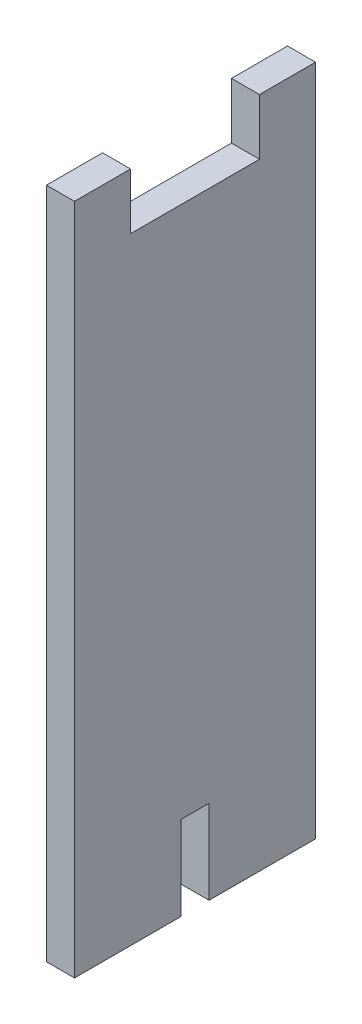
ISO-10303-21;
HEADER;
FILE_DESCRIPTION(('STEP AP214'),'2;1');
FILE_NAME('part.step','',(''),(''),'','','');
FILE_SCHEMA(('AUTOMOTIVE_DESIGN { 1 0 10303 214 1 1 1 1 }'));
ENDSEC;
DATA;
#1=APPLICATION_CONTEXT('core data for automotive mechanical design processes');
#2=APPLICATION_PROTOCOL_DEFINITION('international standard','automotive_design',2000,#1);
#3=PRODUCT_CONTEXT('',#1,'mechanical');
#4=PRODUCT('Part','Part','',(#3));
#5=PRODUCT_RELATED_PRODUCT_CATEGORY('part','',(#4));
#6=PRODUCT_DEFINITION_FORMATION('','',#4);
#7=PRODUCT_DEFINITION_CONTEXT('part definition',#1,'design');
#8=PRODUCT_DEFINITION('design','',#6,#7);
#9=PRODUCT_DEFINITION_SHAPE('','',#8);
#10=(LENGTH_UNIT() NAMED_UNIT(*) SI_UNIT(.MILLI.,.METRE.));
#11=(NAMED_UNIT(*) PLANE_ANGLE_UNIT() SI_UNIT($,.RADIAN.));
#12=(NAMED_UNIT(*) SI_UNIT($,.STERADIAN.) SOLID_ANGLE_UNIT());
#13=UNCERTAINTY_MEASURE_WITH_UNIT(LENGTH_MEASURE(1.E-05),#10,'distance_accuracy_value','');
#14=(GEOMETRIC_REPRESENTATION_CONTEXT(3) GLOBAL_UNCERTAINTY_ASSIGNED_CONTEXT((#13)) GLOBAL_UNIT_ASSIGNED_CONTEXT((#10,
#11,#12)) REPRESENTATION_CONTEXT('',''));
#15=CARTESIAN_POINT('',(0.,0.,0.));
#16=DIRECTION('',(0.,0.,1.));
#17=DIRECTION('',(1.,0.,0.));
#18=AXIS2_PLACEMENT_3D('',#15,#16,#17);
#19=CARTESIAN_POINT('',(5.,0.,0.));
#20=DIRECTION('',(0.,0.,1.));
#21=DIRECTION('',(0.,-1.,0.));
#22=AXIS2_PLACEMENT_3D('',#19,#20,#21);
#23=PLANE('',#22);
#24=DIRECTION('',(0.,1.,0.));
#25=VECTOR('',#24,1.);
#26=CARTESIAN_POINT('',(0.,0.,0.));
#27=LINE('',#26,#25);
#28=CARTESIAN_POINT('',(0.,0.,0.));
#29=VERTEX_POINT('',#28);
#30=CARTESIAN_POINT('',(0.,120.,0.));
#31=VERTEX_POINT('',#30);
#32=EDGE_CURVE('E156',#29,#31,#27,.T.);
#33=ORIENTED_EDGE('',*,*,#32,.T.);
#34=DIRECTION('',(-1.,0.,0.));
#35=VECTOR('',#34,1.);
#36=CARTESIAN_POINT('',(5.,120.,0.));
#37=LINE('',#36,#35);
#38=CARTESIAN_POINT('',(5.,120.,0.));
#39=VERTEX_POINT('',#38);
#40=EDGE_CURVE('E11',#39,#31,#37,.T.);
#41=ORIENTED_EDGE('',*,*,#40,.F.);
#42=DIRECTION('',(0.,1.,0.));
#43=VECTOR('',#42,1.);
#44=CARTESIAN_POINT('',(5.,0.,0.));
#45=LINE('',#44,#43);
#46=CARTESIAN_POINT('',(5.,0.,0.));
#47=VERTEX_POINT('',#46);
#48=EDGE_CURVE('E180',#47,#39,#45,.T.);
#49=ORIENTED_EDGE('',*,*,#48,.F.);
#50=DIRECTION('',(-1.,0.,0.));
#51=VECTOR('',#50,1.);
#52=CARTESIAN_POINT('',(5.,0.,0.));
#53=LINE('',#52,#51);
#54=EDGE_CURVE('E152',#47,#29,#53,.T.);
#55=ORIENTED_EDGE('',*,*,#54,.T.);
#56=EDGE_LOOP('',(#33,#41,#49,#55));
#57=FACE_BOUND('',#56,.T.);
#58=ADVANCED_FACE('F36',(#57),#23,.F.);
#59=CARTESIAN_POINT('',(5.,120.,0.));
#60=DIRECTION('',(0.,-1.,0.));
#61=DIRECTION('',(0.,0.,-1.));
#62=AXIS2_PLACEMENT_3D('',#59,#60,#61);
#63=PLANE('',#62);
#64=DIRECTION('',(0.,0.,1.));
#65=VECTOR('',#64,1.);
#66=CARTESIAN_POINT('',(0.,120.,0.));
#67=LINE('',#66,#65);
#68=CARTESIAN_POINT('',(0.,120.,10.));
#69=VERTEX_POINT('',#68);
#70=EDGE_CURVE('E159',#31,#69,#67,.T.);
#71=ORIENTED_EDGE('',*,*,#70,.T.);
#72=DIRECTION('',(-1.,0.,0.));
#73=VECTOR('',#72,1.);
#74=CARTESIAN_POINT('',(5.,120.,10.));
#75=LINE('',#74,#73);
#76=CARTESIAN_POINT('',(5.,120.,10.));
#77=VERTEX_POINT('',#76);
#78=EDGE_CURVE('E44',#77,#69,#75,.T.);
#79=ORIENTED_EDGE('',*,*,#78,.F.);
#80=DIRECTION('',(0.,0.,1.));
#81=VECTOR('',#80,1.);
#82=CARTESIAN_POINT('',(5.,120.,0.));
#83=LINE('',#82,#81);
#84=EDGE_CURVE('E107',#39,#77,#83,.T.);
#85=ORIENTED_EDGE('',*,*,#84,.F.);
#86=ORIENTED_EDGE('',*,*,#40,.T.);
#87=EDGE_LOOP('',(#71,#79,#85,#86));
#88=FACE_BOUND('',#87,.T.);
#89=ADVANCED_FACE('F207',(#88),#63,.F.);
#90=CARTESIAN_POINT('',(5.,110.,10.));
#91=DIRECTION('',(0.,0.,-1.));
#92=DIRECTION('',(0.,1.,0.));
#93=AXIS2_PLACEMENT_3D('',#90,#91,#92);
#94=PLANE('',#93);
#95=DIRECTION('',(0.,-1.,0.));
#96=VECTOR('',#95,1.);
#97=CARTESIAN_POINT('',(0.,110.,10.));
#98=LINE('',#97,#96);
#99=CARTESIAN_POINT('',(0.,110.,10.));
#100=VERTEX_POINT('',#99);
#101=EDGE_CURVE('E162',#69,#100,#98,.T.);
#102=ORIENTED_EDGE('',*,*,#101,.T.);
#103=DIRECTION('',(-1.,0.,0.));
#104=VECTOR('',#103,1.);
#105=CARTESIAN_POINT('',(5.,110.,10.));
#106=LINE('',#105,#104);
#107=CARTESIAN_POINT('',(5.,110.,10.));
#108=VERTEX_POINT('',#107);
#109=EDGE_CURVE('E199',#108,#100,#106,.T.);
#110=ORIENTED_EDGE('',*,*,#109,.F.);
#111=DIRECTION('',(0.,-1.,0.));
#112=VECTOR('',#111,1.);
#113=CARTESIAN_POINT('',(5.,111.226045357857,10.));
#114=LINE('',#113,#112);
#115=EDGE_CURVE('E206',#77,#108,#114,.T.);
#116=ORIENTED_EDGE('',*,*,#115,.F.);
#117=ORIENTED_EDGE('',*,*,#78,.T.);
#118=EDGE_LOOP('',(#102,#110,#116,#117));
#119=FACE_BOUND('',#118,.T.);
#120=ADVANCED_FACE('F204',(#119),#94,.F.);
#121=CARTESIAN_POINT('',(5.,110.,33.));
#122=DIRECTION('',(0.,-1.,0.));
#123=DIRECTION('',(0.,0.,-1.));
#124=AXIS2_PLACEMENT_3D('',#121,#122,#123);
#125=PLANE('',#124);
#126=DIRECTION('',(0.,0.,1.));
#127=VECTOR('',#126,1.);
#128=CARTESIAN_POINT('',(0.,110.,33.));
#129=LINE('',#128,#127);
#130=CARTESIAN_POINT('',(0.,110.,33.));
#131=VERTEX_POINT('',#130);
#132=EDGE_CURVE('E164',#100,#131,#129,.T.);
#133=ORIENTED_EDGE('',*,*,#132,.T.);
#134=DIRECTION('',(-1.,0.,0.));
#135=VECTOR('',#134,1.);
#136=CARTESIAN_POINT('',(5.,110.,33.));
#137=LINE('',#136,#135);
#138=CARTESIAN_POINT('',(5.,110.,33.));
#139=VERTEX_POINT('',#138);
#140=EDGE_CURVE('E196',#139,#131,#137,.T.);
#141=ORIENTED_EDGE('',*,*,#140,.F.);
#142=DIRECTION('',(0.,0.,1.));
#143=VECTOR('',#142,1.);
#144=CARTESIAN_POINT('',(5.,110.,33.));
#145=LINE('',#144,#143);
#146=EDGE_CURVE('E225',#108,#139,#145,.T.);
#147=ORIENTED_EDGE('',*,*,#146,.F.);
#148=ORIENTED_EDGE('',*,*,#109,.T.);
#149=EDGE_LOOP('',(#133,#141,#147,#148));
#150=FACE_BOUND('',#149,.T.);
#151=ADVANCED_FACE('F216',(#150),#125,.F.);
#152=CARTESIAN_POINT('',(5.,120.,33.));
#153=DIRECTION('',(0.,0.,1.));
#154=DIRECTION('',(1.,0.,0.));
#155=AXIS2_PLACEMENT_3D('',#152,#153,#154);
#156=PLANE('',#155);
#157=DIRECTION('',(0.,1.,0.));
#158=VECTOR('',#157,1.);
#159=CARTESIAN_POINT('',(0.,120.,33.));
#160=LINE('',#159,#158);
#161=CARTESIAN_POINT('',(0.,120.,33.));
#162=VERTEX_POINT('',#161);
#163=EDGE_CURVE('E167',#131,#162,#160,.T.);
#164=ORIENTED_EDGE('',*,*,#163,.T.);
#165=DIRECTION('',(-1.,0.,0.));
#166=VECTOR('',#165,1.);
#167=CARTESIAN_POINT('',(5.,120.,33.));
#168=LINE('',#167,#166);
#169=CARTESIAN_POINT('',(5.,120.,33.));
#170=VERTEX_POINT('',#169);
#171=EDGE_CURVE('E193',#170,#162,#168,.T.);
#172=ORIENTED_EDGE('',*,*,#171,.F.);
#173=DIRECTION('',(0.,1.,0.));
#174=VECTOR('',#173,1.);
#175=CARTESIAN_POINT('',(5.,111.226045357857,33.));
#176=LINE('',#175,#174);
#177=EDGE_CURVE('E222',#139,#170,#176,.T.);
#178=ORIENTED_EDGE('',*,*,#177,.F.);
#179=ORIENTED_EDGE('',*,*,#140,.T.);
#180=EDGE_LOOP('',(#164,#172,#178,#179));
#181=FACE_BOUND('',#180,.T.);
#182=ADVANCED_FACE('F220',(#181),#156,.F.);
#183=CARTESIAN_POINT('',(5.,120.,33.));
#184=DIRECTION('',(0.,-1.,0.));
#185=DIRECTION('',(0.,0.,-1.));
#186=AXIS2_PLACEMENT_3D('',#183,#184,#185);
#187=PLANE('',#186);
#188=DIRECTION('',(0.,0.,1.));
#189=VECTOR('',#188,1.);
#190=CARTESIAN_POINT('',(0.,120.,33.));
#191=LINE('',#190,#189);
#192=CARTESIAN_POINT('',(0.,120.,43.));
#193=VERTEX_POINT('',#192);
#194=EDGE_CURVE('E169',#162,#193,#191,.T.);
#195=ORIENTED_EDGE('',*,*,#194,.T.);
#196=DIRECTION('',(-1.,0.,0.));
#197=VECTOR('',#196,1.);
#198=CARTESIAN_POINT('',(5.,120.,43.));
#199=LINE('',#198,#197);
#200=CARTESIAN_POINT('',(5.,120.,43.));
#201=VERTEX_POINT('',#200);
#202=EDGE_CURVE('E190',#201,#193,#199,.T.);
#203=ORIENTED_EDGE('',*,*,#202,.F.);
#204=DIRECTION('',(0.,0.,1.));
#205=VECTOR('',#204,1.);
#206=CARTESIAN_POINT('',(5.,120.,33.));
#207=LINE('',#206,#205);
#208=EDGE_CURVE('E224',#170,#201,#207,.T.);
#209=ORIENTED_EDGE('',*,*,#208,.F.);
#210=ORIENTED_EDGE('',*,*,#171,.T.);
#211=EDGE_LOOP('',(#195,#203,#209,#210));
#212=FACE_BOUND('',#211,.T.);
#213=ADVANCED_FACE('F249',(#212),#187,.F.);
#214=CARTESIAN_POINT('',(5.,0.,43.));
#215=DIRECTION('',(0.,0.,-1.));
#216=DIRECTION('',(-1.,0.,0.));
#217=AXIS2_PLACEMENT_3D('',#214,#215,#216);
#218=PLANE('',#217);
#219=DIRECTION('',(0.,-1.,0.));
#220=VECTOR('',#219,1.);
#221=CARTESIAN_POINT('',(0.,0.,43.));
#222=LINE('',#221,#220);
#223=CARTESIAN_POINT('',(0.,0.,43.));
#224=VERTEX_POINT('',#223);
#225=EDGE_CURVE('E171',#193,#224,#222,.T.);
#226=ORIENTED_EDGE('',*,*,#225,.T.);
#227=DIRECTION('',(-1.,0.,0.));
#228=VECTOR('',#227,1.);
#229=CARTESIAN_POINT('',(5.,0.,43.));
#230=LINE('',#229,#228);
#231=CARTESIAN_POINT('',(5.,0.,43.));
#232=VERTEX_POINT('',#231);
#233=EDGE_CURVE('E187',#232,#224,#230,.T.);
#234=ORIENTED_EDGE('',*,*,#233,.F.);
#235=DIRECTION('',(0.,-1.,0.));
#236=VECTOR('',#235,1.);
#237=CARTESIAN_POINT('',(5.,0.,43.));
#238=LINE('',#237,#236);
#239=EDGE_CURVE('E227',#201,#232,#238,.T.);
#240=ORIENTED_EDGE('',*,*,#239,.F.);
#241=ORIENTED_EDGE('',*,*,#202,.T.);
#242=EDGE_LOOP('',(#226,#234,#240,#241));
#243=FACE_BOUND('',#242,.T.);
#244=ADVANCED_FACE('F246',(#243),#218,.F.);
#245=CARTESIAN_POINT('',(5.,0.,24.));
#246=DIRECTION('',(0.,1.,0.));
#247=DIRECTION('',(0.,0.,1.));
#248=AXIS2_PLACEMENT_3D('',#245,#246,#247);
#249=PLANE('',#248);
#250=DIRECTION('',(0.,0.,-1.));
#251=VECTOR('',#250,1.);
#252=CARTESIAN_POINT('',(0.,0.,24.));
#253=LINE('',#252,#251);
#254=CARTESIAN_POINT('',(0.,0.,24.));
#255=VERTEX_POINT('',#254);
#256=EDGE_CURVE('E173',#224,#255,#253,.T.);
#257=ORIENTED_EDGE('',*,*,#256,.T.);
#258=DIRECTION('',(-1.,0.,0.));
#259=VECTOR('',#258,1.);
#260=CARTESIAN_POINT('',(5.,0.,24.));
#261=LINE('',#260,#259);
#262=CARTESIAN_POINT('',(5.,0.,24.));
#263=VERTEX_POINT('',#262);
#264=EDGE_CURVE('E184',#263,#255,#261,.T.);
#265=ORIENTED_EDGE('',*,*,#264,.F.);
#266=DIRECTION('',(0.,0.,-1.));
#267=VECTOR('',#266,1.);
#268=CARTESIAN_POINT('',(5.,0.,24.));
#269=LINE('',#268,#267);
#270=EDGE_CURVE('E233',#232,#263,#269,.T.);
#271=ORIENTED_EDGE('',*,*,#270,.F.);
#272=ORIENTED_EDGE('',*,*,#233,.T.);
#273=EDGE_LOOP('',(#257,#265,#271,#272));
#274=FACE_BOUND('',#273,.T.);
#275=ADVANCED_FACE('F239',(#274),#249,.F.);
#276=CARTESIAN_POINT('',(5.,0.,24.));
#277=DIRECTION('',(0.,0.,1.));
#278=DIRECTION('',(1.,0.,0.));
#279=AXIS2_PLACEMENT_3D('',#276,#277,#278);
#280=PLANE('',#279);
#281=DIRECTION('',(0.,1.,0.));
#282=VECTOR('',#281,1.);
#283=CARTESIAN_POINT('',(0.,0.,24.));
#284=LINE('',#283,#282);
#285=CARTESIAN_POINT('',(0.,15.,24.));
#286=VERTEX_POINT('',#285);
#287=EDGE_CURVE('E175',#255,#286,#284,.T.);
#288=ORIENTED_EDGE('',*,*,#287,.T.);
#289=DIRECTION('',(-1.,0.,0.));
#290=VECTOR('',#289,1.);
#291=CARTESIAN_POINT('',(5.,15.,24.));
#292=LINE('',#291,#290);
#293=CARTESIAN_POINT('',(5.,15.,24.));
#294=VERTEX_POINT('',#293);
#295=EDGE_CURVE('E147',#294,#286,#292,.T.);
#296=ORIENTED_EDGE('',*,*,#295,.F.);
#297=DIRECTION('',(0.,1.,0.));
#298=VECTOR('',#297,1.);
#299=CARTESIAN_POINT('',(5.,0.,24.));
#300=LINE('',#299,#298);
#301=EDGE_CURVE('E138',#263,#294,#300,.T.);
#302=ORIENTED_EDGE('',*,*,#301,.F.);
#303=ORIENTED_EDGE('',*,*,#264,.T.);
#304=EDGE_LOOP('',(#288,#296,#302,#303));
#305=FACE_BOUND('',#304,.T.);
#306=ADVANCED_FACE('F243',(#305),#280,.F.);
#307=CARTESIAN_POINT('',(5.,15.,24.));
#308=DIRECTION('',(0.,1.,0.));
#309=DIRECTION('',(0.,0.,1.));
#310=AXIS2_PLACEMENT_3D('',#307,#308,#309);
#311=PLANE('',#310);
#312=DIRECTION('',(0.,0.,-1.));
#313=VECTOR('',#312,1.);
#314=CARTESIAN_POINT('',(0.,15.,24.));
#315=LINE('',#314,#313);
#316=CARTESIAN_POINT('',(0.,15.,19.));
#317=VERTEX_POINT('',#316);
#318=EDGE_CURVE('E146',#286,#317,#315,.T.);
#319=ORIENTED_EDGE('',*,*,#318,.T.);
#320=DIRECTION('',(-1.,0.,0.));
#321=VECTOR('',#320,1.);
#322=CARTESIAN_POINT('',(5.,15.,19.));
#323=LINE('',#322,#321);
#324=CARTESIAN_POINT('',(5.,15.,19.));
#325=VERTEX_POINT('',#324);
#326=EDGE_CURVE('E143',#325,#317,#323,.T.);
#327=ORIENTED_EDGE('',*,*,#326,.F.);
#328=DIRECTION('',(0.,0.,-1.));
#329=VECTOR('',#328,1.);
#330=CARTESIAN_POINT('',(5.,15.,24.));
#331=LINE('',#330,#329);
#332=EDGE_CURVE('E132',#294,#325,#331,.T.);
#333=ORIENTED_EDGE('',*,*,#332,.F.);
#334=ORIENTED_EDGE('',*,*,#295,.T.);
#335=EDGE_LOOP('',(#319,#327,#333,#334));
#336=FACE_BOUND('',#335,.T.);
#337=ADVANCED_FACE('F144',(#336),#311,.F.);
#338=CARTESIAN_POINT('',(5.,15.,19.));
#339=DIRECTION('',(0.,0.,-1.));
#340=DIRECTION('',(0.,1.,0.));
#341=AXIS2_PLACEMENT_3D('',#338,#339,#340);
#342=PLANE('',#341);
#343=DIRECTION('',(0.,-1.,0.));
#344=VECTOR('',#343,1.);
#345=CARTESIAN_POINT('',(0.,15.,19.));
#346=LINE('',#345,#344);
#347=CARTESIAN_POINT('',(0.,0.,19.));
#348=VERTEX_POINT('',#347);
#349=EDGE_CURVE('E93',#317,#348,#346,.T.);
#350=ORIENTED_EDGE('',*,*,#349,.T.);
#351=DIRECTION('',(-1.,0.,0.));
#352=VECTOR('',#351,1.);
#353=CARTESIAN_POINT('',(5.,0.,19.));
#354=LINE('',#353,#352);
#355=CARTESIAN_POINT('',(5.,0.,19.));
#356=VERTEX_POINT('',#355);
#357=EDGE_CURVE('E148',#356,#348,#354,.T.);
#358=ORIENTED_EDGE('',*,*,#357,.F.);
#359=DIRECTION('',(0.,-1.,0.));
#360=VECTOR('',#359,1.);
#361=CARTESIAN_POINT('',(5.,15.,19.));
#362=LINE('',#361,#360);
#363=EDGE_CURVE('E136',#325,#356,#362,.T.);
#364=ORIENTED_EDGE('',*,*,#363,.F.);
#365=ORIENTED_EDGE('',*,*,#326,.T.);
#366=EDGE_LOOP('',(#350,#358,#364,#365));
#367=FACE_BOUND('',#366,.T.);
#368=ADVANCED_FACE('F150',(#367),#342,.F.);
#369=CARTESIAN_POINT('',(5.,0.,0.));
#370=DIRECTION('',(0.,1.,0.));
#371=DIRECTION('',(0.,0.,1.));
#372=AXIS2_PLACEMENT_3D('',#369,#370,#371);
#373=PLANE('',#372);
#374=DIRECTION('',(0.,0.,-1.));
#375=VECTOR('',#374,1.);
#376=CARTESIAN_POINT('',(0.,0.,0.));
#377=LINE('',#376,#375);
#378=EDGE_CURVE('E99',#348,#29,#377,.T.);
#379=ORIENTED_EDGE('',*,*,#378,.T.);
#380=ORIENTED_EDGE('',*,*,#54,.F.);
#381=DIRECTION('',(0.,0.,-1.));
#382=VECTOR('',#381,1.);
#383=CARTESIAN_POINT('',(5.,0.,0.));
#384=LINE('',#383,#382);
#385=EDGE_CURVE('E52',#356,#47,#384,.T.);
#386=ORIENTED_EDGE('',*,*,#385,.F.);
#387=ORIENTED_EDGE('',*,*,#357,.T.);
#388=EDGE_LOOP('',(#379,#380,#386,#387));
#389=FACE_BOUND('',#388,.T.);
#390=ADVANCED_FACE('F264',(#389),#373,.F.);
#391=CARTESIAN_POINT('',(5.,0.,0.));
#392=DIRECTION('',(1.,0.,0.));
#393=DIRECTION('',(0.,0.,-1.));
#394=AXIS2_PLACEMENT_3D('',#391,#392,#393);
#395=PLANE('',#394);
#396=ORIENTED_EDGE('',*,*,#48,.T.);
#397=ORIENTED_EDGE('',*,*,#84,.T.);
#398=ORIENTED_EDGE('',*,*,#115,.T.);
#399=ORIENTED_EDGE('',*,*,#146,.T.);
#400=ORIENTED_EDGE('',*,*,#177,.T.);
#401=ORIENTED_EDGE('',*,*,#208,.T.);
#402=ORIENTED_EDGE('',*,*,#239,.T.);
#403=ORIENTED_EDGE('',*,*,#270,.T.);
#404=ORIENTED_EDGE('',*,*,#301,.T.);
#405=ORIENTED_EDGE('',*,*,#332,.T.);
#406=ORIENTED_EDGE('',*,*,#363,.T.);
#407=ORIENTED_EDGE('',*,*,#385,.T.);
#408=EDGE_LOOP('',(#396,#397,#398,#399,#400,#401,#402,#403,#404,#405,#406,#407));
#409=FACE_BOUND('',#408,.T.);
#410=ADVANCED_FACE('F134',(#409),#395,.T.);
#411=CARTESIAN_POINT('',(0.,0.,0.));
#412=DIRECTION('',(1.,0.,0.));
#413=DIRECTION('',(0.,0.,-1.));
#414=AXIS2_PLACEMENT_3D('',#411,#412,#413);
#415=PLANE('',#414);
#416=ORIENTED_EDGE('',*,*,#32,.F.);
#417=ORIENTED_EDGE('',*,*,#378,.F.);
#418=ORIENTED_EDGE('',*,*,#349,.F.);
#419=ORIENTED_EDGE('',*,*,#318,.F.);
#420=ORIENTED_EDGE('',*,*,#287,.F.);
#421=ORIENTED_EDGE('',*,*,#256,.F.);
#422=ORIENTED_EDGE('',*,*,#225,.F.);
#423=ORIENTED_EDGE('',*,*,#194,.F.);
#424=ORIENTED_EDGE('',*,*,#163,.F.);
#425=ORIENTED_EDGE('',*,*,#132,.F.);
#426=ORIENTED_EDGE('',*,*,#101,.F.);
#427=ORIENTED_EDGE('',*,*,#70,.F.);
#428=EDGE_LOOP('',(#416,#417,#418,#419,#420,#421,#422,#423,#424,#425,#426,#427));
#429=FACE_BOUND('',#428,.T.);
#430=ADVANCED_FACE('F211',(#429),#415,.F.);
#431=CLOSED_SHELL('',(#58,#89,#120,#151,#182,#213,#244,#275,#306,#337,#368,#390,#410,#430));
#432=MANIFOLD_SOLID_BREP('B2',#431);
#433=ADVANCED_BREP_SHAPE_REPRESENTATION('',(#18,#432),#14);
#434=SHAPE_DEFINITION_REPRESENTATION(#9,#433);
ENDSEC;
END-ISO-10303-21;
